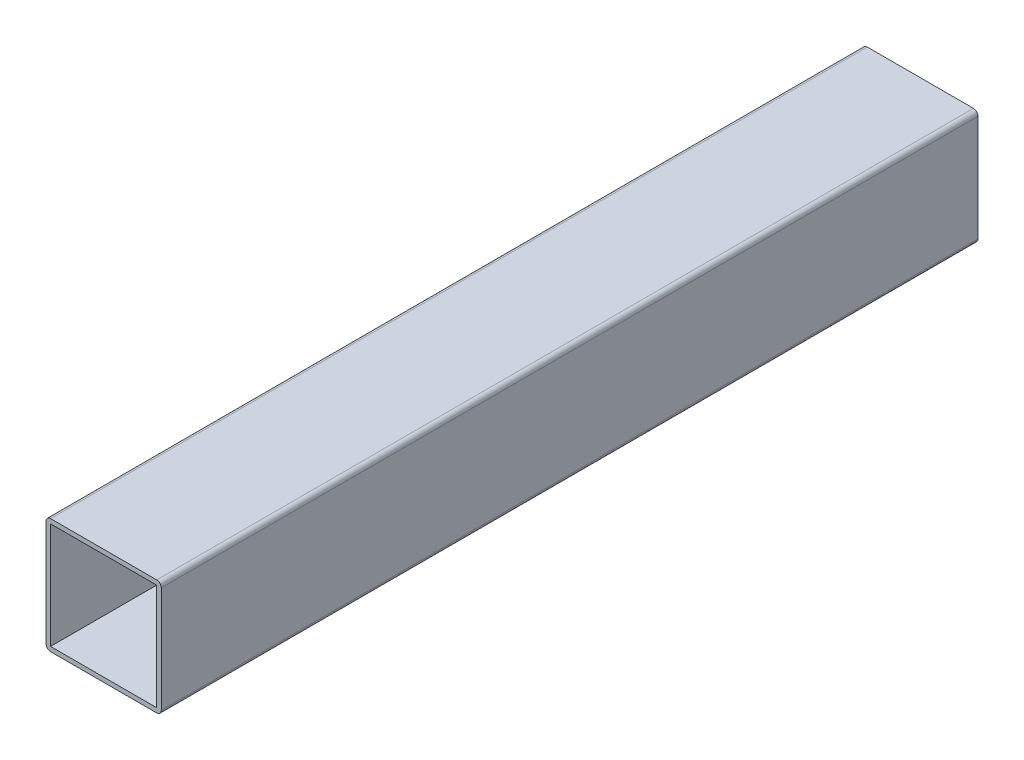
ISO-10303-21;
HEADER;
FILE_DESCRIPTION(('STEP AP214'),'2;1');
FILE_NAME('part.step','',(''),(''),'','','');
FILE_SCHEMA(('AUTOMOTIVE_DESIGN { 1 0 10303 214 1 1 1 1 }'));
ENDSEC;
DATA;
#1=APPLICATION_CONTEXT('core data for automotive mechanical design processes');
#2=APPLICATION_PROTOCOL_DEFINITION('international standard','automotive_design',2000,#1);
#3=PRODUCT_CONTEXT('',#1,'mechanical');
#4=PRODUCT('Part','Part','',(#3));
#5=PRODUCT_RELATED_PRODUCT_CATEGORY('part','',(#4));
#6=PRODUCT_DEFINITION_FORMATION('','',#4);
#7=PRODUCT_DEFINITION_CONTEXT('part definition',#1,'design');
#8=PRODUCT_DEFINITION('design','',#6,#7);
#9=PRODUCT_DEFINITION_SHAPE('','',#8);
#10=(LENGTH_UNIT() NAMED_UNIT(*) SI_UNIT(.MILLI.,.METRE.));
#11=(NAMED_UNIT(*) PLANE_ANGLE_UNIT() SI_UNIT($,.RADIAN.));
#12=(NAMED_UNIT(*) SI_UNIT($,.STERADIAN.) SOLID_ANGLE_UNIT());
#13=UNCERTAINTY_MEASURE_WITH_UNIT(LENGTH_MEASURE(1.E-05),#10,'distance_accuracy_value','');
#14=(GEOMETRIC_REPRESENTATION_CONTEXT(3) GLOBAL_UNCERTAINTY_ASSIGNED_CONTEXT((#13)) GLOBAL_UNIT_ASSIGNED_CONTEXT((#10,
#11,#12)) REPRESENTATION_CONTEXT('',''));
#15=CARTESIAN_POINT('',(0.,0.,0.));
#16=DIRECTION('',(0.,0.,1.));
#17=DIRECTION('',(1.,0.,0.));
#18=AXIS2_PLACEMENT_3D('',#15,#16,#17);
#19=CARTESIAN_POINT('',(-11.7,-11.7,-180.));
#20=DIRECTION('',(0.,0.,1.));
#21=DIRECTION('',(1.,0.,0.));
#22=AXIS2_PLACEMENT_3D('',#19,#20,#21);
#23=CYLINDRICAL_SURFACE('',#22,0.999999999999998);
#24=CARTESIAN_POINT('',(-11.7,-11.7,0.));
#25=DIRECTION('',(0.,0.,1.));
#26=DIRECTION('',(-1.,0.,0.));
#27=AXIS2_PLACEMENT_3D('',#24,#25,#26);
#28=CIRCLE('',#27,0.999999999999998);
#29=CARTESIAN_POINT('',(-12.7,-11.7,0.));
#30=VERTEX_POINT('',#29);
#31=CARTESIAN_POINT('',(-11.7,-12.7,0.));
#32=VERTEX_POINT('',#31);
#33=EDGE_CURVE('E155',#30,#32,#28,.T.);
#34=ORIENTED_EDGE('',*,*,#33,.F.);
#35=DIRECTION('',(0.,0.,1.));
#36=VECTOR('',#35,1.);
#37=CARTESIAN_POINT('',(-12.7,-11.7,-180.));
#38=LINE('',#37,#36);
#39=CARTESIAN_POINT('',(-12.7,-11.7,-180.));
#40=VERTEX_POINT('',#39);
#41=EDGE_CURVE('E11',#40,#30,#38,.T.);
#42=ORIENTED_EDGE('',*,*,#41,.F.);
#43=CARTESIAN_POINT('',(-11.7,-11.7,-180.));
#44=DIRECTION('',(0.,0.,1.));
#45=DIRECTION('',(-1.,0.,0.));
#46=AXIS2_PLACEMENT_3D('',#43,#44,#45);
#47=CIRCLE('',#46,0.999999999999998);
#48=CARTESIAN_POINT('',(-11.7,-12.7,-180.));
#49=VERTEX_POINT('',#48);
#50=EDGE_CURVE('E159',#40,#49,#47,.T.);
#51=ORIENTED_EDGE('',*,*,#50,.T.);
#52=DIRECTION('',(0.,0.,1.));
#53=VECTOR('',#52,1.);
#54=CARTESIAN_POINT('',(-11.7,-12.7,-180.));
#55=LINE('',#54,#53);
#56=EDGE_CURVE('E36',#49,#32,#55,.T.);
#57=ORIENTED_EDGE('',*,*,#56,.T.);
#58=EDGE_LOOP('',(#34,#42,#51,#57));
#59=FACE_BOUND('',#58,.T.);
#60=ADVANCED_FACE('F33',(#59),#23,.T.);
#61=CARTESIAN_POINT('',(-12.7,-11.7,-180.));
#62=DIRECTION('',(-1.,0.,0.));
#63=DIRECTION('',(0.,0.,1.));
#64=AXIS2_PLACEMENT_3D('',#61,#62,#63);
#65=PLANE('',#64);
#66=DIRECTION('',(0.,-1.,0.));
#67=VECTOR('',#66,1.);
#68=CARTESIAN_POINT('',(-12.7,-11.7,0.));
#69=LINE('',#68,#67);
#70=CARTESIAN_POINT('',(-12.7,11.7,0.));
#71=VERTEX_POINT('',#70);
#72=EDGE_CURVE('E163',#71,#30,#69,.T.);
#73=ORIENTED_EDGE('',*,*,#72,.F.);
#74=DIRECTION('',(0.,0.,1.));
#75=VECTOR('',#74,1.);
#76=CARTESIAN_POINT('',(-12.7,11.7,-180.));
#77=LINE('',#76,#75);
#78=CARTESIAN_POINT('',(-12.7,11.7,-180.));
#79=VERTEX_POINT('',#78);
#80=EDGE_CURVE('E41',#79,#71,#77,.T.);
#81=ORIENTED_EDGE('',*,*,#80,.F.);
#82=DIRECTION('',(0.,-1.,0.));
#83=VECTOR('',#82,1.);
#84=CARTESIAN_POINT('',(-12.7,-11.7,-180.));
#85=LINE('',#84,#83);
#86=EDGE_CURVE('E181',#79,#40,#85,.T.);
#87=ORIENTED_EDGE('',*,*,#86,.T.);
#88=ORIENTED_EDGE('',*,*,#41,.T.);
#89=EDGE_LOOP('',(#73,#81,#87,#88));
#90=FACE_BOUND('',#89,.T.);
#91=ADVANCED_FACE('F228',(#90),#65,.T.);
#92=CARTESIAN_POINT('',(-11.7,11.7,-180.));
#93=DIRECTION('',(0.,0.,1.));
#94=DIRECTION('',(1.,0.,0.));
#95=AXIS2_PLACEMENT_3D('',#92,#93,#94);
#96=CYLINDRICAL_SURFACE('',#95,0.999999999999999);
#97=CARTESIAN_POINT('',(-11.7,11.7,0.));
#98=DIRECTION('',(0.,0.,1.));
#99=DIRECTION('',(-1.,0.,0.));
#100=AXIS2_PLACEMENT_3D('',#97,#98,#99);
#101=CIRCLE('',#100,0.999999999999999);
#102=CARTESIAN_POINT('',(-11.7,12.7,0.));
#103=VERTEX_POINT('',#102);
#104=EDGE_CURVE('E201',#103,#71,#101,.T.);
#105=ORIENTED_EDGE('',*,*,#104,.F.);
#106=DIRECTION('',(0.,0.,1.));
#107=VECTOR('',#106,1.);
#108=CARTESIAN_POINT('',(-11.7,12.7,-180.));
#109=LINE('',#108,#107);
#110=CARTESIAN_POINT('',(-11.7,12.7,-180.));
#111=VERTEX_POINT('',#110);
#112=EDGE_CURVE('E207',#111,#103,#109,.T.);
#113=ORIENTED_EDGE('',*,*,#112,.F.);
#114=CARTESIAN_POINT('',(-11.7,11.7,-180.));
#115=DIRECTION('',(0.,0.,1.));
#116=DIRECTION('',(-1.,0.,0.));
#117=AXIS2_PLACEMENT_3D('',#114,#115,#116);
#118=CIRCLE('',#117,0.999999999999999);
#119=EDGE_CURVE('E178',#111,#79,#118,.T.);
#120=ORIENTED_EDGE('',*,*,#119,.T.);
#121=ORIENTED_EDGE('',*,*,#80,.T.);
#122=EDGE_LOOP('',(#105,#113,#120,#121));
#123=FACE_BOUND('',#122,.T.);
#124=ADVANCED_FACE('F247',(#123),#96,.T.);
#125=CARTESIAN_POINT('',(-11.7,12.7,-180.));
#126=DIRECTION('',(0.,1.,0.));
#127=DIRECTION('',(0.,0.,1.));
#128=AXIS2_PLACEMENT_3D('',#125,#126,#127);
#129=PLANE('',#128);
#130=DIRECTION('',(-1.,0.,0.));
#131=VECTOR('',#130,1.);
#132=CARTESIAN_POINT('',(-11.7,12.7,0.));
#133=LINE('',#132,#131);
#134=CARTESIAN_POINT('',(11.7,12.7,0.));
#135=VERTEX_POINT('',#134);
#136=EDGE_CURVE('E198',#135,#103,#133,.T.);
#137=ORIENTED_EDGE('',*,*,#136,.F.);
#138=DIRECTION('',(0.,0.,1.));
#139=VECTOR('',#138,1.);
#140=CARTESIAN_POINT('',(11.7,12.7,-180.));
#141=LINE('',#140,#139);
#142=CARTESIAN_POINT('',(11.7,12.7,-180.));
#143=VERTEX_POINT('',#142);
#144=EDGE_CURVE('E209',#143,#135,#141,.T.);
#145=ORIENTED_EDGE('',*,*,#144,.F.);
#146=DIRECTION('',(-1.,0.,0.));
#147=VECTOR('',#146,1.);
#148=CARTESIAN_POINT('',(-11.7,12.7,-180.));
#149=LINE('',#148,#147);
#150=EDGE_CURVE('E175',#143,#111,#149,.T.);
#151=ORIENTED_EDGE('',*,*,#150,.T.);
#152=ORIENTED_EDGE('',*,*,#112,.T.);
#153=EDGE_LOOP('',(#137,#145,#151,#152));
#154=FACE_BOUND('',#153,.T.);
#155=ADVANCED_FACE('F245',(#154),#129,.T.);
#156=CARTESIAN_POINT('',(11.7,11.7,-180.));
#157=DIRECTION('',(0.,0.,1.));
#158=DIRECTION('',(1.,0.,0.));
#159=AXIS2_PLACEMENT_3D('',#156,#157,#158);
#160=CYLINDRICAL_SURFACE('',#159,1.);
#161=CARTESIAN_POINT('',(11.7,11.7,0.));
#162=DIRECTION('',(0.,0.,1.));
#163=DIRECTION('',(-1.,0.,0.));
#164=AXIS2_PLACEMENT_3D('',#161,#162,#163);
#165=CIRCLE('',#164,1.);
#166=CARTESIAN_POINT('',(12.7,11.7,0.));
#167=VERTEX_POINT('',#166);
#168=EDGE_CURVE('E195',#167,#135,#165,.T.);
#169=ORIENTED_EDGE('',*,*,#168,.F.);
#170=DIRECTION('',(0.,0.,1.));
#171=VECTOR('',#170,1.);
#172=CARTESIAN_POINT('',(12.7,11.7,-180.));
#173=LINE('',#172,#171);
#174=CARTESIAN_POINT('',(12.7,11.7,-180.));
#175=VERTEX_POINT('',#174);
#176=EDGE_CURVE('E211',#175,#167,#173,.T.);
#177=ORIENTED_EDGE('',*,*,#176,.F.);
#178=CARTESIAN_POINT('',(11.7,11.7,-180.));
#179=DIRECTION('',(0.,0.,1.));
#180=DIRECTION('',(-1.,0.,0.));
#181=AXIS2_PLACEMENT_3D('',#178,#179,#180);
#182=CIRCLE('',#181,1.);
#183=EDGE_CURVE('E172',#175,#143,#182,.T.);
#184=ORIENTED_EDGE('',*,*,#183,.T.);
#185=ORIENTED_EDGE('',*,*,#144,.T.);
#186=EDGE_LOOP('',(#169,#177,#184,#185));
#187=FACE_BOUND('',#186,.T.);
#188=ADVANCED_FACE('F241',(#187),#160,.T.);
#189=CARTESIAN_POINT('',(12.7,-11.7,-180.));
#190=DIRECTION('',(1.,0.,0.));
#191=DIRECTION('',(0.,0.,-1.));
#192=AXIS2_PLACEMENT_3D('',#189,#190,#191);
#193=PLANE('',#192);
#194=DIRECTION('',(0.,1.,0.));
#195=VECTOR('',#194,1.);
#196=CARTESIAN_POINT('',(12.7,-11.7,0.));
#197=LINE('',#196,#195);
#198=CARTESIAN_POINT('',(12.7,-11.7,0.));
#199=VERTEX_POINT('',#198);
#200=EDGE_CURVE('E192',#199,#167,#197,.T.);
#201=ORIENTED_EDGE('',*,*,#200,.F.);
#202=DIRECTION('',(0.,0.,1.));
#203=VECTOR('',#202,1.);
#204=CARTESIAN_POINT('',(12.7,-11.7,-180.));
#205=LINE('',#204,#203);
#206=CARTESIAN_POINT('',(12.7,-11.7,-180.));
#207=VERTEX_POINT('',#206);
#208=EDGE_CURVE('E213',#207,#199,#205,.T.);
#209=ORIENTED_EDGE('',*,*,#208,.F.);
#210=DIRECTION('',(0.,1.,0.));
#211=VECTOR('',#210,1.);
#212=CARTESIAN_POINT('',(12.7,-11.7,-180.));
#213=LINE('',#212,#211);
#214=EDGE_CURVE('E169',#207,#175,#213,.T.);
#215=ORIENTED_EDGE('',*,*,#214,.T.);
#216=ORIENTED_EDGE('',*,*,#176,.T.);
#217=EDGE_LOOP('',(#201,#209,#215,#216));
#218=FACE_BOUND('',#217,.T.);
#219=ADVANCED_FACE('F239',(#218),#193,.T.);
#220=CARTESIAN_POINT('',(11.7,-11.7,-180.));
#221=DIRECTION('',(0.,0.,1.));
#222=DIRECTION('',(1.,0.,0.));
#223=AXIS2_PLACEMENT_3D('',#220,#221,#222);
#224=CYLINDRICAL_SURFACE('',#223,1.);
#225=CARTESIAN_POINT('',(11.7,-11.7,0.));
#226=DIRECTION('',(0.,0.,1.));
#227=DIRECTION('',(1.,0.,0.));
#228=AXIS2_PLACEMENT_3D('',#225,#226,#227);
#229=CIRCLE('',#228,1.);
#230=CARTESIAN_POINT('',(11.7,-12.7,0.));
#231=VERTEX_POINT('',#230);
#232=EDGE_CURVE('E189',#231,#199,#229,.T.);
#233=ORIENTED_EDGE('',*,*,#232,.F.);
#234=DIRECTION('',(0.,0.,1.));
#235=VECTOR('',#234,1.);
#236=CARTESIAN_POINT('',(11.7,-12.7,-180.));
#237=LINE('',#236,#235);
#238=CARTESIAN_POINT('',(11.7,-12.7,-180.));
#239=VERTEX_POINT('',#238);
#240=EDGE_CURVE('E214',#239,#231,#237,.T.);
#241=ORIENTED_EDGE('',*,*,#240,.F.);
#242=CARTESIAN_POINT('',(11.7,-11.7,-180.));
#243=DIRECTION('',(0.,0.,1.));
#244=DIRECTION('',(1.,0.,0.));
#245=AXIS2_PLACEMENT_3D('',#242,#243,#244);
#246=CIRCLE('',#245,1.);
#247=EDGE_CURVE('E166',#239,#207,#246,.T.);
#248=ORIENTED_EDGE('',*,*,#247,.T.);
#249=ORIENTED_EDGE('',*,*,#208,.T.);
#250=EDGE_LOOP('',(#233,#241,#248,#249));
#251=FACE_BOUND('',#250,.T.);
#252=ADVANCED_FACE('F235',(#251),#224,.T.);
#253=CARTESIAN_POINT('',(-11.7,-12.7,-180.));
#254=DIRECTION('',(0.,-1.,0.));
#255=DIRECTION('',(1.,0.,0.));
#256=AXIS2_PLACEMENT_3D('',#253,#254,#255);
#257=PLANE('',#256);
#258=DIRECTION('',(1.,0.,0.));
#259=VECTOR('',#258,1.);
#260=CARTESIAN_POINT('',(-11.7,-12.7,0.));
#261=LINE('',#260,#259);
#262=EDGE_CURVE('E186',#32,#231,#261,.T.);
#263=ORIENTED_EDGE('',*,*,#262,.F.);
#264=ORIENTED_EDGE('',*,*,#56,.F.);
#265=DIRECTION('',(1.,0.,0.));
#266=VECTOR('',#265,1.);
#267=CARTESIAN_POINT('',(-11.7,-12.7,-180.));
#268=LINE('',#267,#266);
#269=EDGE_CURVE('E162',#49,#239,#268,.T.);
#270=ORIENTED_EDGE('',*,*,#269,.T.);
#271=ORIENTED_EDGE('',*,*,#240,.T.);
#272=EDGE_LOOP('',(#263,#264,#270,#271));
#273=FACE_BOUND('',#272,.T.);
#274=ADVANCED_FACE('F222',(#273),#257,.T.);
#275=CARTESIAN_POINT('',(-11.7,-11.7,-180.));
#276=DIRECTION('',(0.,0.,-1.));
#277=DIRECTION('',(-1.,0.,0.));
#278=AXIS2_PLACEMENT_3D('',#275,#276,#277);
#279=PLANE('',#278);
#280=DIRECTION('',(0.,-1.,0.));
#281=VECTOR('',#280,1.);
#282=CARTESIAN_POINT('',(-11.7,-11.7,-180.));
#283=LINE('',#282,#281);
#284=CARTESIAN_POINT('',(-11.7,11.7,-180.));
#285=VERTEX_POINT('',#284);
#286=CARTESIAN_POINT('',(-11.7,-11.7,-180.));
#287=VERTEX_POINT('',#286);
#288=EDGE_CURVE('E124',#285,#287,#283,.T.);
#289=ORIENTED_EDGE('',*,*,#288,.T.);
#290=DIRECTION('',(1.,0.,0.));
#291=VECTOR('',#290,1.);
#292=CARTESIAN_POINT('',(-11.7,-11.7,-180.));
#293=LINE('',#292,#291);
#294=CARTESIAN_POINT('',(11.7,-11.7,-180.));
#295=VERTEX_POINT('',#294);
#296=EDGE_CURVE('E133',#287,#295,#293,.T.);
#297=ORIENTED_EDGE('',*,*,#296,.T.);
#298=DIRECTION('',(0.,1.,0.));
#299=VECTOR('',#298,1.);
#300=CARTESIAN_POINT('',(11.7,-11.7,-180.));
#301=LINE('',#300,#299);
#302=CARTESIAN_POINT('',(11.7,11.7,-180.));
#303=VERTEX_POINT('',#302);
#304=EDGE_CURVE('E49',#295,#303,#301,.T.);
#305=ORIENTED_EDGE('',*,*,#304,.T.);
#306=DIRECTION('',(-1.,0.,0.));
#307=VECTOR('',#306,1.);
#308=CARTESIAN_POINT('',(-11.7,11.7,-180.));
#309=LINE('',#308,#307);
#310=EDGE_CURVE('E130',#303,#285,#309,.T.);
#311=ORIENTED_EDGE('',*,*,#310,.T.);
#312=EDGE_LOOP('',(#289,#297,#305,#311));
#313=FACE_BOUND('',#312,.T.);
#314=ORIENTED_EDGE('',*,*,#50,.F.);
#315=ORIENTED_EDGE('',*,*,#86,.F.);
#316=ORIENTED_EDGE('',*,*,#119,.F.);
#317=ORIENTED_EDGE('',*,*,#150,.F.);
#318=ORIENTED_EDGE('',*,*,#183,.F.);
#319=ORIENTED_EDGE('',*,*,#214,.F.);
#320=ORIENTED_EDGE('',*,*,#247,.F.);
#321=ORIENTED_EDGE('',*,*,#269,.F.);
#322=EDGE_LOOP('',(#314,#315,#316,#317,#318,#319,#320,#321));
#323=FACE_BOUND('',#322,.T.);
#324=ADVANCED_FACE('F137',(#313,#323),#279,.T.);
#325=CARTESIAN_POINT('',(-11.7,-11.7,0.));
#326=DIRECTION('',(0.,0.,-1.));
#327=DIRECTION('',(-1.,0.,0.));
#328=AXIS2_PLACEMENT_3D('',#325,#326,#327);
#329=PLANE('',#328);
#330=DIRECTION('',(1.,0.,0.));
#331=VECTOR('',#330,1.);
#332=CARTESIAN_POINT('',(-11.7,-11.7,0.));
#333=LINE('',#332,#331);
#334=CARTESIAN_POINT('',(-11.7,-11.7,0.));
#335=VERTEX_POINT('',#334);
#336=CARTESIAN_POINT('',(11.7,-11.7,0.));
#337=VERTEX_POINT('',#336);
#338=EDGE_CURVE('E149',#335,#337,#333,.T.);
#339=ORIENTED_EDGE('',*,*,#338,.F.);
#340=DIRECTION('',(0.,-1.,0.));
#341=VECTOR('',#340,1.);
#342=CARTESIAN_POINT('',(-11.7,-11.7,0.));
#343=LINE('',#342,#341);
#344=CARTESIAN_POINT('',(-11.7,11.7,0.));
#345=VERTEX_POINT('',#344);
#346=EDGE_CURVE('E57',#345,#335,#343,.T.);
#347=ORIENTED_EDGE('',*,*,#346,.F.);
#348=DIRECTION('',(-1.,0.,0.));
#349=VECTOR('',#348,1.);
#350=CARTESIAN_POINT('',(-11.7,11.7,0.));
#351=LINE('',#350,#349);
#352=CARTESIAN_POINT('',(11.7,11.7,0.));
#353=VERTEX_POINT('',#352);
#354=EDGE_CURVE('E140',#353,#345,#351,.T.);
#355=ORIENTED_EDGE('',*,*,#354,.F.);
#356=DIRECTION('',(0.,1.,0.));
#357=VECTOR('',#356,1.);
#358=CARTESIAN_POINT('',(11.7,-11.7,0.));
#359=LINE('',#358,#357);
#360=EDGE_CURVE('E143',#337,#353,#359,.T.);
#361=ORIENTED_EDGE('',*,*,#360,.F.);
#362=EDGE_LOOP('',(#339,#347,#355,#361));
#363=FACE_BOUND('',#362,.T.);
#364=ORIENTED_EDGE('',*,*,#33,.T.);
#365=ORIENTED_EDGE('',*,*,#262,.T.);
#366=ORIENTED_EDGE('',*,*,#232,.T.);
#367=ORIENTED_EDGE('',*,*,#200,.T.);
#368=ORIENTED_EDGE('',*,*,#168,.T.);
#369=ORIENTED_EDGE('',*,*,#136,.T.);
#370=ORIENTED_EDGE('',*,*,#104,.T.);
#371=ORIENTED_EDGE('',*,*,#72,.T.);
#372=EDGE_LOOP('',(#364,#365,#366,#367,#368,#369,#370,#371));
#373=FACE_BOUND('',#372,.T.);
#374=ADVANCED_FACE('F224',(#363,#373),#329,.F.);
#375=CARTESIAN_POINT('',(-11.7,-11.7,-180.));
#376=DIRECTION('',(-1.,0.,0.));
#377=DIRECTION('',(0.,0.,1.));
#378=AXIS2_PLACEMENT_3D('',#375,#376,#377);
#379=PLANE('',#378);
#380=ORIENTED_EDGE('',*,*,#346,.T.);
#381=DIRECTION('',(0.,0.,1.));
#382=VECTOR('',#381,1.);
#383=CARTESIAN_POINT('',(-11.7,-11.7,-180.));
#384=LINE('',#383,#382);
#385=EDGE_CURVE('E120',#287,#335,#384,.T.);
#386=ORIENTED_EDGE('',*,*,#385,.F.);
#387=ORIENTED_EDGE('',*,*,#288,.F.);
#388=DIRECTION('',(0.,0.,1.));
#389=VECTOR('',#388,1.);
#390=CARTESIAN_POINT('',(-11.7,11.7,-180.));
#391=LINE('',#390,#389);
#392=EDGE_CURVE('E153',#285,#345,#391,.T.);
#393=ORIENTED_EDGE('',*,*,#392,.T.);
#394=EDGE_LOOP('',(#380,#386,#387,#393));
#395=FACE_BOUND('',#394,.T.);
#396=ADVANCED_FACE('F122',(#395),#379,.F.);
#397=CARTESIAN_POINT('',(-11.7,11.7,-180.));
#398=DIRECTION('',(0.,1.,0.));
#399=DIRECTION('',(0.,0.,1.));
#400=AXIS2_PLACEMENT_3D('',#397,#398,#399);
#401=PLANE('',#400);
#402=ORIENTED_EDGE('',*,*,#354,.T.);
#403=ORIENTED_EDGE('',*,*,#392,.F.);
#404=ORIENTED_EDGE('',*,*,#310,.F.);
#405=DIRECTION('',(0.,0.,1.));
#406=VECTOR('',#405,1.);
#407=CARTESIAN_POINT('',(11.7,11.7,-180.));
#408=LINE('',#407,#406);
#409=EDGE_CURVE('E156',#303,#353,#408,.T.);
#410=ORIENTED_EDGE('',*,*,#409,.T.);
#411=EDGE_LOOP('',(#402,#403,#404,#410));
#412=FACE_BOUND('',#411,.T.);
#413=ADVANCED_FACE('F330',(#412),#401,.F.);
#414=CARTESIAN_POINT('',(11.7,-11.7,-180.));
#415=DIRECTION('',(1.,0.,0.));
#416=DIRECTION('',(0.,1.,0.));
#417=AXIS2_PLACEMENT_3D('',#414,#415,#416);
#418=PLANE('',#417);
#419=ORIENTED_EDGE('',*,*,#360,.T.);
#420=ORIENTED_EDGE('',*,*,#409,.F.);
#421=ORIENTED_EDGE('',*,*,#304,.F.);
#422=DIRECTION('',(0.,0.,1.));
#423=VECTOR('',#422,1.);
#424=CARTESIAN_POINT('',(11.7,-11.7,-180.));
#425=LINE('',#424,#423);
#426=EDGE_CURVE('E129',#295,#337,#425,.T.);
#427=ORIENTED_EDGE('',*,*,#426,.T.);
#428=EDGE_LOOP('',(#419,#420,#421,#427));
#429=FACE_BOUND('',#428,.T.);
#430=ADVANCED_FACE('F339',(#429),#418,.F.);
#431=CARTESIAN_POINT('',(-11.7,-11.7,-180.));
#432=DIRECTION('',(0.,-1.,0.));
#433=DIRECTION('',(0.,0.,-1.));
#434=AXIS2_PLACEMENT_3D('',#431,#432,#433);
#435=PLANE('',#434);
#436=ORIENTED_EDGE('',*,*,#338,.T.);
#437=ORIENTED_EDGE('',*,*,#426,.F.);
#438=ORIENTED_EDGE('',*,*,#296,.F.);
#439=ORIENTED_EDGE('',*,*,#385,.T.);
#440=EDGE_LOOP('',(#436,#437,#438,#439));
#441=FACE_BOUND('',#440,.T.);
#442=ADVANCED_FACE('F134',(#441),#435,.F.);
#443=CLOSED_SHELL('',(#60,#91,#124,#155,#188,#219,#252,#274,#324,#374,#396,#413,#430,#442));
#444=MANIFOLD_SOLID_BREP('B2',#443);
#445=ADVANCED_BREP_SHAPE_REPRESENTATION('',(#18,#444),#14);
#446=SHAPE_DEFINITION_REPRESENTATION(#9,#445);
ENDSEC;
END-ISO-10303-21;
